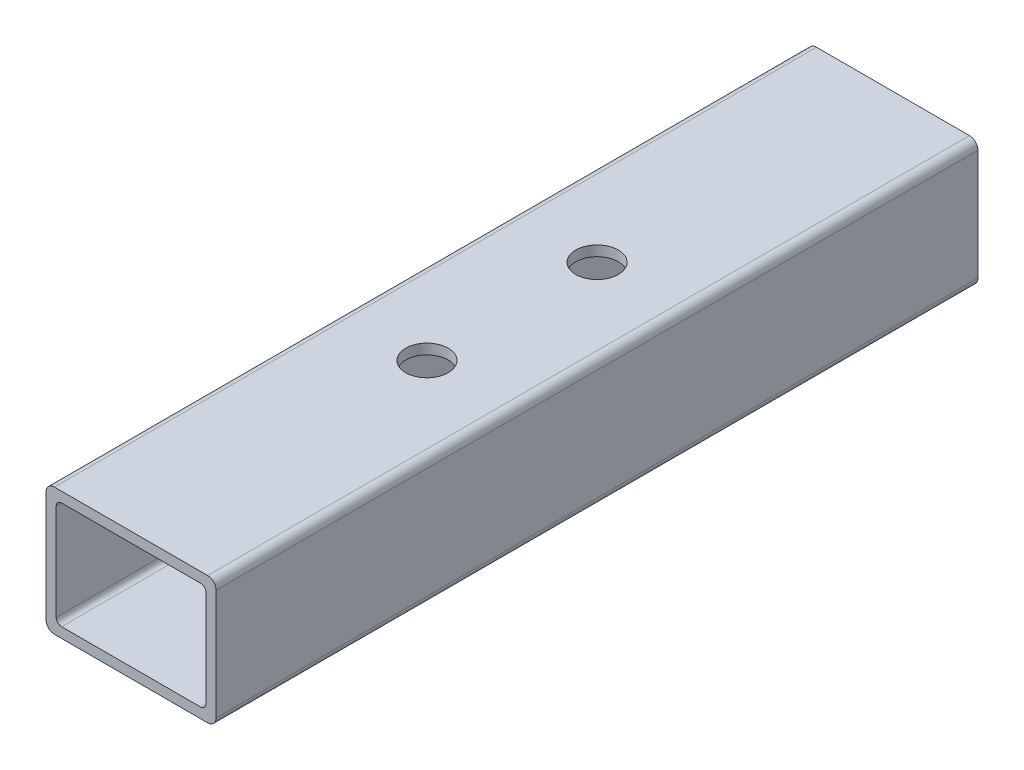
ISO-10303-21;
HEADER;
FILE_DESCRIPTION(('STEP AP214'),'2;1');
FILE_NAME('part.step','',(''),(''),'','','');
FILE_SCHEMA(('AUTOMOTIVE_DESIGN { 1 0 10303 214 1 1 1 1 }'));
ENDSEC;
DATA;
#1=APPLICATION_CONTEXT('core data for automotive mechanical design processes');
#2=APPLICATION_PROTOCOL_DEFINITION('international standard','automotive_design',2000,#1);
#3=PRODUCT_CONTEXT('',#1,'mechanical');
#4=PRODUCT('Part','Part','',(#3));
#5=PRODUCT_RELATED_PRODUCT_CATEGORY('part','',(#4));
#6=PRODUCT_DEFINITION_FORMATION('','',#4);
#7=PRODUCT_DEFINITION_CONTEXT('part definition',#1,'design');
#8=PRODUCT_DEFINITION('design','',#6,#7);
#9=PRODUCT_DEFINITION_SHAPE('','',#8);
#10=(LENGTH_UNIT() NAMED_UNIT(*) SI_UNIT(.MILLI.,.METRE.));
#11=(NAMED_UNIT(*) PLANE_ANGLE_UNIT() SI_UNIT($,.RADIAN.));
#12=(NAMED_UNIT(*) SI_UNIT($,.STERADIAN.) SOLID_ANGLE_UNIT());
#13=UNCERTAINTY_MEASURE_WITH_UNIT(LENGTH_MEASURE(1.E-05),#10,'distance_accuracy_value','');
#14=(GEOMETRIC_REPRESENTATION_CONTEXT(3) GLOBAL_UNCERTAINTY_ASSIGNED_CONTEXT((#13)) GLOBAL_UNIT_ASSIGNED_CONTEXT((#10,
#11,#12)) REPRESENTATION_CONTEXT('',''));
#15=CARTESIAN_POINT('',(0.,0.,0.));
#16=DIRECTION('',(0.,0.,1.));
#17=DIRECTION('',(1.,0.,0.));
#18=AXIS2_PLACEMENT_3D('',#15,#16,#17);
#19=CARTESIAN_POINT('',(22.86,-16.51,227.56368));
#20=DIRECTION('',(0.,0.,1.));
#21=DIRECTION('',(1.,0.,0.));
#22=AXIS2_PLACEMENT_3D('',#19,#20,#21);
#23=PLANE('',#22);
#24=CARTESIAN_POINT('',(22.86,-16.51,227.56368));
#25=DIRECTION('',(0.,0.,1.));
#26=DIRECTION('',(1.,0.,0.));
#27=AXIS2_PLACEMENT_3D('',#24,#25,#26);
#28=CIRCLE('',#27,2.53999999999999);
#29=CARTESIAN_POINT('',(22.86,-19.05,227.56368));
#30=VERTEX_POINT('',#29);
#31=CARTESIAN_POINT('',(25.4,-16.51,227.56368));
#32=VERTEX_POINT('',#31);
#33=EDGE_CURVE('E219',#30,#32,#28,.T.);
#34=ORIENTED_EDGE('',*,*,#33,.T.);
#35=DIRECTION('',(0.,1.,0.));
#36=VECTOR('',#35,1.);
#37=CARTESIAN_POINT('',(25.4,-16.51,227.56368));
#38=LINE('',#37,#36);
#39=CARTESIAN_POINT('',(25.4,16.51,227.56368));
#40=VERTEX_POINT('',#39);
#41=EDGE_CURVE('E222',#32,#40,#38,.T.);
#42=ORIENTED_EDGE('',*,*,#41,.T.);
#43=CARTESIAN_POINT('',(22.86,16.51,227.56368));
#44=DIRECTION('',(0.,0.,1.));
#45=DIRECTION('',(1.,0.,0.));
#46=AXIS2_PLACEMENT_3D('',#43,#44,#45);
#47=CIRCLE('',#46,2.54);
#48=CARTESIAN_POINT('',(22.86,19.05,227.56368));
#49=VERTEX_POINT('',#48);
#50=EDGE_CURVE('E225',#40,#49,#47,.T.);
#51=ORIENTED_EDGE('',*,*,#50,.T.);
#52=DIRECTION('',(-1.,0.,0.));
#53=VECTOR('',#52,1.);
#54=CARTESIAN_POINT('',(22.86,19.05,227.56368));
#55=LINE('',#54,#53);
#56=CARTESIAN_POINT('',(-22.86,19.05,227.56368));
#57=VERTEX_POINT('',#56);
#58=EDGE_CURVE('E227',#49,#57,#55,.T.);
#59=ORIENTED_EDGE('',*,*,#58,.T.);
#60=CARTESIAN_POINT('',(-22.86,16.51,227.56368));
#61=DIRECTION('',(0.,0.,1.));
#62=DIRECTION('',(1.,0.,0.));
#63=AXIS2_PLACEMENT_3D('',#60,#61,#62);
#64=CIRCLE('',#63,2.54);
#65=CARTESIAN_POINT('',(-25.4,16.51,227.56368));
#66=VERTEX_POINT('',#65);
#67=EDGE_CURVE('E229',#57,#66,#64,.T.);
#68=ORIENTED_EDGE('',*,*,#67,.T.);
#69=DIRECTION('',(0.,-1.,0.));
#70=VECTOR('',#69,1.);
#71=CARTESIAN_POINT('',(-25.4,-16.51,227.56368));
#72=LINE('',#71,#70);
#73=CARTESIAN_POINT('',(-25.4,-16.51,227.56368));
#74=VERTEX_POINT('',#73);
#75=EDGE_CURVE('E231',#66,#74,#72,.T.);
#76=ORIENTED_EDGE('',*,*,#75,.T.);
#77=CARTESIAN_POINT('',(-22.86,-16.51,227.56368));
#78=DIRECTION('',(0.,0.,1.));
#79=DIRECTION('',(1.,0.,0.));
#80=AXIS2_PLACEMENT_3D('',#77,#78,#79);
#81=CIRCLE('',#80,2.54);
#82=CARTESIAN_POINT('',(-22.86,-19.05,227.56368));
#83=VERTEX_POINT('',#82);
#84=EDGE_CURVE('E233',#74,#83,#81,.T.);
#85=ORIENTED_EDGE('',*,*,#84,.T.);
#86=DIRECTION('',(1.,0.,0.));
#87=VECTOR('',#86,1.);
#88=CARTESIAN_POINT('',(22.86,-19.05,227.56368));
#89=LINE('',#88,#87);
#90=EDGE_CURVE('E235',#83,#30,#89,.T.);
#91=ORIENTED_EDGE('',*,*,#90,.T.);
#92=EDGE_LOOP('',(#34,#42,#51,#59,#68,#76,#85,#91));
#93=FACE_BOUND('',#92,.T.);
#94=DIRECTION('',(-1.,0.,0.));
#95=VECTOR('',#94,1.);
#96=CARTESIAN_POINT('',(20.7518,16.002,227.56368));
#97=LINE('',#96,#95);
#98=CARTESIAN_POINT('',(20.7518,16.002,227.56368));
#99=VERTEX_POINT('',#98);
#100=CARTESIAN_POINT('',(-20.7518,16.002,227.56368));
#101=VERTEX_POINT('',#100);
#102=EDGE_CURVE('E160',#99,#101,#97,.T.);
#103=ORIENTED_EDGE('',*,*,#102,.F.);
#104=CARTESIAN_POINT('',(20.7518,14.4018,227.56368));
#105=DIRECTION('',(0.,0.,1.));
#106=DIRECTION('',(1.,0.,0.));
#107=AXIS2_PLACEMENT_3D('',#104,#105,#106);
#108=CIRCLE('',#107,1.6002);
#109=CARTESIAN_POINT('',(22.352,14.4018,227.56368));
#110=VERTEX_POINT('',#109);
#111=EDGE_CURVE('E152',#110,#99,#108,.T.);
#112=ORIENTED_EDGE('',*,*,#111,.F.);
#113=DIRECTION('',(0.,1.,0.));
#114=VECTOR('',#113,1.);
#115=CARTESIAN_POINT('',(22.352,14.4018,227.56368));
#116=LINE('',#115,#114);
#117=CARTESIAN_POINT('',(22.352,-14.4018,227.56368));
#118=VERTEX_POINT('',#117);
#119=EDGE_CURVE('E186',#118,#110,#116,.T.);
#120=ORIENTED_EDGE('',*,*,#119,.F.);
#121=CARTESIAN_POINT('',(20.7518,-14.4018,227.56368));
#122=DIRECTION('',(0.,0.,1.));
#123=DIRECTION('',(1.,0.,0.));
#124=AXIS2_PLACEMENT_3D('',#121,#122,#123);
#125=CIRCLE('',#124,1.6002);
#126=CARTESIAN_POINT('',(20.7518,-16.002,227.56368));
#127=VERTEX_POINT('',#126);
#128=EDGE_CURVE('E184',#127,#118,#125,.T.);
#129=ORIENTED_EDGE('',*,*,#128,.F.);
#130=DIRECTION('',(1.,0.,0.));
#131=VECTOR('',#130,1.);
#132=CARTESIAN_POINT('',(20.7518,-16.002,227.56368));
#133=LINE('',#132,#131);
#134=CARTESIAN_POINT('',(-20.7518,-16.002,227.56368));
#135=VERTEX_POINT('',#134);
#136=EDGE_CURVE('E182',#135,#127,#133,.T.);
#137=ORIENTED_EDGE('',*,*,#136,.F.);
#138=CARTESIAN_POINT('',(-20.7518,-14.4018,227.56368));
#139=DIRECTION('',(0.,0.,1.));
#140=DIRECTION('',(1.,0.,0.));
#141=AXIS2_PLACEMENT_3D('',#138,#139,#140);
#142=CIRCLE('',#141,1.6002);
#143=CARTESIAN_POINT('',(-22.352,-14.4018,227.56368));
#144=VERTEX_POINT('',#143);
#145=EDGE_CURVE('E180',#144,#135,#142,.T.);
#146=ORIENTED_EDGE('',*,*,#145,.F.);
#147=DIRECTION('',(0.,-1.,0.));
#148=VECTOR('',#147,1.);
#149=CARTESIAN_POINT('',(-22.352,14.4018,227.56368));
#150=LINE('',#149,#148);
#151=CARTESIAN_POINT('',(-22.352,14.4018,227.56368));
#152=VERTEX_POINT('',#151);
#153=EDGE_CURVE('E175',#152,#144,#150,.T.);
#154=ORIENTED_EDGE('',*,*,#153,.F.);
#155=CARTESIAN_POINT('',(-20.7518,14.4018,227.56368));
#156=DIRECTION('',(0.,0.,1.));
#157=DIRECTION('',(1.,0.,0.));
#158=AXIS2_PLACEMENT_3D('',#155,#156,#157);
#159=CIRCLE('',#158,1.6002);
#160=EDGE_CURVE('E173',#101,#152,#159,.T.);
#161=ORIENTED_EDGE('',*,*,#160,.F.);
#162=EDGE_LOOP('',(#103,#112,#120,#129,#137,#146,#154,#161));
#163=FACE_BOUND('',#162,.T.);
#164=ADVANCED_FACE('F39',(#93,#163),#23,.T.);
#165=CARTESIAN_POINT('',(22.86,-16.51,0.));
#166=DIRECTION('',(0.,0.,1.));
#167=DIRECTION('',(1.,0.,0.));
#168=AXIS2_PLACEMENT_3D('',#165,#166,#167);
#169=PLANE('',#168);
#170=CARTESIAN_POINT('',(22.86,-16.51,0.));
#171=DIRECTION('',(0.,0.,1.));
#172=DIRECTION('',(1.,0.,0.));
#173=AXIS2_PLACEMENT_3D('',#170,#171,#172);
#174=CIRCLE('',#173,2.53999999999999);
#175=CARTESIAN_POINT('',(22.86,-19.05,0.));
#176=VERTEX_POINT('',#175);
#177=CARTESIAN_POINT('',(25.4,-16.51,0.));
#178=VERTEX_POINT('',#177);
#179=EDGE_CURVE('E168',#176,#178,#174,.T.);
#180=ORIENTED_EDGE('',*,*,#179,.F.);
#181=DIRECTION('',(1.,0.,0.));
#182=VECTOR('',#181,1.);
#183=CARTESIAN_POINT('',(22.86,-19.05,0.));
#184=LINE('',#183,#182);
#185=CARTESIAN_POINT('',(-22.86,-19.05,0.));
#186=VERTEX_POINT('',#185);
#187=EDGE_CURVE('E223',#186,#176,#184,.T.);
#188=ORIENTED_EDGE('',*,*,#187,.F.);
#189=CARTESIAN_POINT('',(-22.86,-16.51,0.));
#190=DIRECTION('',(0.,0.,1.));
#191=DIRECTION('',(1.,0.,0.));
#192=AXIS2_PLACEMENT_3D('',#189,#190,#191);
#193=CIRCLE('',#192,2.54);
#194=CARTESIAN_POINT('',(-25.4,-16.51,0.));
#195=VERTEX_POINT('',#194);
#196=EDGE_CURVE('E250',#195,#186,#193,.T.);
#197=ORIENTED_EDGE('',*,*,#196,.F.);
#198=DIRECTION('',(0.,-1.,0.));
#199=VECTOR('',#198,1.);
#200=CARTESIAN_POINT('',(-25.4,-16.51,0.));
#201=LINE('',#200,#199);
#202=CARTESIAN_POINT('',(-25.4,16.51,0.));
#203=VERTEX_POINT('',#202);
#204=EDGE_CURVE('E248',#203,#195,#201,.T.);
#205=ORIENTED_EDGE('',*,*,#204,.F.);
#206=CARTESIAN_POINT('',(-22.86,16.51,0.));
#207=DIRECTION('',(0.,0.,1.));
#208=DIRECTION('',(1.,0.,0.));
#209=AXIS2_PLACEMENT_3D('',#206,#207,#208);
#210=CIRCLE('',#209,2.54);
#211=CARTESIAN_POINT('',(-22.86,19.05,0.));
#212=VERTEX_POINT('',#211);
#213=EDGE_CURVE('E246',#212,#203,#210,.T.);
#214=ORIENTED_EDGE('',*,*,#213,.F.);
#215=DIRECTION('',(-1.,0.,0.));
#216=VECTOR('',#215,1.);
#217=CARTESIAN_POINT('',(22.86,19.05,0.));
#218=LINE('',#217,#216);
#219=CARTESIAN_POINT('',(22.86,19.05,0.));
#220=VERTEX_POINT('',#219);
#221=EDGE_CURVE('E244',#220,#212,#218,.T.);
#222=ORIENTED_EDGE('',*,*,#221,.F.);
#223=CARTESIAN_POINT('',(22.86,16.51,0.));
#224=DIRECTION('',(0.,0.,1.));
#225=DIRECTION('',(1.,0.,0.));
#226=AXIS2_PLACEMENT_3D('',#223,#224,#225);
#227=CIRCLE('',#226,2.54);
#228=CARTESIAN_POINT('',(25.4,16.51,0.));
#229=VERTEX_POINT('',#228);
#230=EDGE_CURVE('E242',#229,#220,#227,.T.);
#231=ORIENTED_EDGE('',*,*,#230,.F.);
#232=DIRECTION('',(0.,1.,0.));
#233=VECTOR('',#232,1.);
#234=CARTESIAN_POINT('',(25.4,-16.51,0.));
#235=LINE('',#234,#233);
#236=EDGE_CURVE('E240',#178,#229,#235,.T.);
#237=ORIENTED_EDGE('',*,*,#236,.F.);
#238=EDGE_LOOP('',(#180,#188,#197,#205,#214,#222,#231,#237));
#239=FACE_BOUND('',#238,.T.);
#240=CARTESIAN_POINT('',(20.7518,14.4018,0.));
#241=DIRECTION('',(0.,0.,1.));
#242=DIRECTION('',(1.,0.,0.));
#243=AXIS2_PLACEMENT_3D('',#240,#241,#242);
#244=CIRCLE('',#243,1.6002);
#245=CARTESIAN_POINT('',(22.352,14.4018,0.));
#246=VERTEX_POINT('',#245);
#247=CARTESIAN_POINT('',(20.7518,16.002,0.));
#248=VERTEX_POINT('',#247);
#249=EDGE_CURVE('E62',#246,#248,#244,.T.);
#250=ORIENTED_EDGE('',*,*,#249,.T.);
#251=DIRECTION('',(-1.,0.,0.));
#252=VECTOR('',#251,1.);
#253=CARTESIAN_POINT('',(20.7518,16.002,0.));
#254=LINE('',#253,#252);
#255=CARTESIAN_POINT('',(-20.7518,16.002,0.));
#256=VERTEX_POINT('',#255);
#257=EDGE_CURVE('E167',#248,#256,#254,.T.);
#258=ORIENTED_EDGE('',*,*,#257,.T.);
#259=CARTESIAN_POINT('',(-20.7518,14.4018,0.));
#260=DIRECTION('',(0.,0.,1.));
#261=DIRECTION('',(1.,0.,0.));
#262=AXIS2_PLACEMENT_3D('',#259,#260,#261);
#263=CIRCLE('',#262,1.6002);
#264=CARTESIAN_POINT('',(-22.352,14.4018,0.));
#265=VERTEX_POINT('',#264);
#266=EDGE_CURVE('E191',#256,#265,#263,.T.);
#267=ORIENTED_EDGE('',*,*,#266,.T.);
#268=DIRECTION('',(0.,-1.,0.));
#269=VECTOR('',#268,1.);
#270=CARTESIAN_POINT('',(-22.352,14.4018,0.));
#271=LINE('',#270,#269);
#272=CARTESIAN_POINT('',(-22.352,-14.4018,0.));
#273=VERTEX_POINT('',#272);
#274=EDGE_CURVE('E194',#265,#273,#271,.T.);
#275=ORIENTED_EDGE('',*,*,#274,.T.);
#276=CARTESIAN_POINT('',(-20.7518,-14.4018,0.));
#277=DIRECTION('',(0.,0.,1.));
#278=DIRECTION('',(1.,0.,0.));
#279=AXIS2_PLACEMENT_3D('',#276,#277,#278);
#280=CIRCLE('',#279,1.6002);
#281=CARTESIAN_POINT('',(-20.7518,-16.002,0.));
#282=VERTEX_POINT('',#281);
#283=EDGE_CURVE('E197',#273,#282,#280,.T.);
#284=ORIENTED_EDGE('',*,*,#283,.T.);
#285=DIRECTION('',(1.,0.,0.));
#286=VECTOR('',#285,1.);
#287=CARTESIAN_POINT('',(20.7518,-16.002,0.));
#288=LINE('',#287,#286);
#289=CARTESIAN_POINT('',(20.7518,-16.002,0.));
#290=VERTEX_POINT('',#289);
#291=EDGE_CURVE('E200',#282,#290,#288,.T.);
#292=ORIENTED_EDGE('',*,*,#291,.T.);
#293=CARTESIAN_POINT('',(20.7518,-14.4018,0.));
#294=DIRECTION('',(0.,0.,1.));
#295=DIRECTION('',(1.,0.,0.));
#296=AXIS2_PLACEMENT_3D('',#293,#294,#295);
#297=CIRCLE('',#296,1.6002);
#298=CARTESIAN_POINT('',(22.352,-14.4018,0.));
#299=VERTEX_POINT('',#298);
#300=EDGE_CURVE('E203',#290,#299,#297,.T.);
#301=ORIENTED_EDGE('',*,*,#300,.T.);
#302=DIRECTION('',(0.,1.,0.));
#303=VECTOR('',#302,1.);
#304=CARTESIAN_POINT('',(22.352,14.4018,0.));
#305=LINE('',#304,#303);
#306=EDGE_CURVE('E161',#299,#246,#305,.T.);
#307=ORIENTED_EDGE('',*,*,#306,.T.);
#308=EDGE_LOOP('',(#250,#258,#267,#275,#284,#292,#301,#307));
#309=FACE_BOUND('',#308,.T.);
#310=ADVANCED_FACE('F280',(#239,#309),#169,.F.);
#311=CARTESIAN_POINT('',(22.86,-16.51,227.56368));
#312=DIRECTION('',(0.,0.,-1.));
#313=DIRECTION('',(-1.,0.,0.));
#314=AXIS2_PLACEMENT_3D('',#311,#312,#313);
#315=CYLINDRICAL_SURFACE('',#314,2.53999999999999);
#316=ORIENTED_EDGE('',*,*,#179,.T.);
#317=DIRECTION('',(0.,0.,-1.));
#318=VECTOR('',#317,1.);
#319=CARTESIAN_POINT('',(25.4,-16.51,227.56368));
#320=LINE('',#319,#318);
#321=EDGE_CURVE('E11',#32,#178,#320,.T.);
#322=ORIENTED_EDGE('',*,*,#321,.F.);
#323=ORIENTED_EDGE('',*,*,#33,.F.);
#324=DIRECTION('',(0.,0.,-1.));
#325=VECTOR('',#324,1.);
#326=CARTESIAN_POINT('',(22.86,-19.05,227.56368));
#327=LINE('',#326,#325);
#328=EDGE_CURVE('E237',#30,#176,#327,.T.);
#329=ORIENTED_EDGE('',*,*,#328,.T.);
#330=EDGE_LOOP('',(#316,#322,#323,#329));
#331=FACE_BOUND('',#330,.T.);
#332=ADVANCED_FACE('F41',(#331),#315,.T.);
#333=CARTESIAN_POINT('',(25.4,-16.51,227.56368));
#334=DIRECTION('',(-1.,0.,0.));
#335=DIRECTION('',(0.,0.,1.));
#336=AXIS2_PLACEMENT_3D('',#333,#334,#335);
#337=PLANE('',#336);
#338=ORIENTED_EDGE('',*,*,#236,.T.);
#339=DIRECTION('',(0.,0.,-1.));
#340=VECTOR('',#339,1.);
#341=CARTESIAN_POINT('',(25.4,16.51,227.56368));
#342=LINE('',#341,#340);
#343=EDGE_CURVE('E47',#40,#229,#342,.T.);
#344=ORIENTED_EDGE('',*,*,#343,.F.);
#345=ORIENTED_EDGE('',*,*,#41,.F.);
#346=ORIENTED_EDGE('',*,*,#321,.T.);
#347=EDGE_LOOP('',(#338,#344,#345,#346));
#348=FACE_BOUND('',#347,.T.);
#349=ADVANCED_FACE('F297',(#348),#337,.F.);
#350=CARTESIAN_POINT('',(22.86,16.51,227.56368));
#351=DIRECTION('',(0.,0.,-1.));
#352=DIRECTION('',(-1.,0.,0.));
#353=AXIS2_PLACEMENT_3D('',#350,#351,#352);
#354=CYLINDRICAL_SURFACE('',#353,2.54);
#355=ORIENTED_EDGE('',*,*,#230,.T.);
#356=DIRECTION('',(0.,0.,-1.));
#357=VECTOR('',#356,1.);
#358=CARTESIAN_POINT('',(22.86,19.05,227.56368));
#359=LINE('',#358,#357);
#360=EDGE_CURVE('E267',#49,#220,#359,.T.);
#361=ORIENTED_EDGE('',*,*,#360,.F.);
#362=ORIENTED_EDGE('',*,*,#50,.F.);
#363=ORIENTED_EDGE('',*,*,#343,.T.);
#364=EDGE_LOOP('',(#355,#361,#362,#363));
#365=FACE_BOUND('',#364,.T.);
#366=ADVANCED_FACE('F274',(#365),#354,.T.);
#367=CARTESIAN_POINT('',(22.86,19.05,227.56368));
#368=DIRECTION('',(0.,-1.,0.));
#369=DIRECTION('',(0.,0.,-1.));
#370=AXIS2_PLACEMENT_3D('',#367,#368,#369);
#371=PLANE('',#370);
#372=CARTESIAN_POINT('',(0.,19.05,139.18184));
#373=DIRECTION('',(0.,1.,0.));
#374=DIRECTION('',(0.,0.,1.));
#375=AXIS2_PLACEMENT_3D('',#372,#373,#374);
#376=CIRCLE('',#375,6.34999999999999);
#377=CARTESIAN_POINT('',(0.,19.05,145.53184));
#378=VERTEX_POINT('',#377);
#379=EDGE_CURVE('E189',#378,#378,#376,.T.);
#380=ORIENTED_EDGE('',*,*,#379,.F.);
#381=EDGE_LOOP('',(#380));
#382=FACE_BOUND('',#381,.T.);
#383=CARTESIAN_POINT('',(0.,19.05,88.38184));
#384=DIRECTION('',(0.,1.,0.));
#385=DIRECTION('',(0.,0.,1.));
#386=AXIS2_PLACEMENT_3D('',#383,#384,#385);
#387=CIRCLE('',#386,6.34999999999999);
#388=CARTESIAN_POINT('',(0.,19.05,94.73184));
#389=VERTEX_POINT('',#388);
#390=EDGE_CURVE('E380',#389,#389,#387,.T.);
#391=ORIENTED_EDGE('',*,*,#390,.F.);
#392=EDGE_LOOP('',(#391));
#393=FACE_BOUND('',#392,.T.);
#394=ORIENTED_EDGE('',*,*,#221,.T.);
#395=DIRECTION('',(0.,0.,-1.));
#396=VECTOR('',#395,1.);
#397=CARTESIAN_POINT('',(-22.86,19.05,227.56368));
#398=LINE('',#397,#396);
#399=EDGE_CURVE('E264',#57,#212,#398,.T.);
#400=ORIENTED_EDGE('',*,*,#399,.F.);
#401=ORIENTED_EDGE('',*,*,#58,.F.);
#402=ORIENTED_EDGE('',*,*,#360,.T.);
#403=EDGE_LOOP('',(#394,#400,#401,#402));
#404=FACE_BOUND('',#403,.T.);
#405=ADVANCED_FACE('F286',(#382,#393,#404),#371,.F.);
#406=CARTESIAN_POINT('',(-22.86,16.51,227.56368));
#407=DIRECTION('',(0.,0.,-1.));
#408=DIRECTION('',(-1.,0.,0.));
#409=AXIS2_PLACEMENT_3D('',#406,#407,#408);
#410=CYLINDRICAL_SURFACE('',#409,2.54);
#411=ORIENTED_EDGE('',*,*,#213,.T.);
#412=DIRECTION('',(0.,0.,-1.));
#413=VECTOR('',#412,1.);
#414=CARTESIAN_POINT('',(-25.4,16.51,227.56368));
#415=LINE('',#414,#413);
#416=EDGE_CURVE('E261',#66,#203,#415,.T.);
#417=ORIENTED_EDGE('',*,*,#416,.F.);
#418=ORIENTED_EDGE('',*,*,#67,.F.);
#419=ORIENTED_EDGE('',*,*,#399,.T.);
#420=EDGE_LOOP('',(#411,#417,#418,#419));
#421=FACE_BOUND('',#420,.T.);
#422=ADVANCED_FACE('F290',(#421),#410,.T.);
#423=CARTESIAN_POINT('',(-25.4,-16.51,227.56368));
#424=DIRECTION('',(1.,0.,0.));
#425=DIRECTION('',(0.,1.,0.));
#426=AXIS2_PLACEMENT_3D('',#423,#424,#425);
#427=PLANE('',#426);
#428=ORIENTED_EDGE('',*,*,#204,.T.);
#429=DIRECTION('',(0.,0.,-1.));
#430=VECTOR('',#429,1.);
#431=CARTESIAN_POINT('',(-25.4,-16.51,227.56368));
#432=LINE('',#431,#430);
#433=EDGE_CURVE('E258',#74,#195,#432,.T.);
#434=ORIENTED_EDGE('',*,*,#433,.F.);
#435=ORIENTED_EDGE('',*,*,#75,.F.);
#436=ORIENTED_EDGE('',*,*,#416,.T.);
#437=EDGE_LOOP('',(#428,#434,#435,#436));
#438=FACE_BOUND('',#437,.T.);
#439=ADVANCED_FACE('F310',(#438),#427,.F.);
#440=CARTESIAN_POINT('',(-22.86,-16.51,227.56368));
#441=DIRECTION('',(0.,0.,-1.));
#442=DIRECTION('',(-1.,0.,0.));
#443=AXIS2_PLACEMENT_3D('',#440,#441,#442);
#444=CYLINDRICAL_SURFACE('',#443,2.54);
#445=ORIENTED_EDGE('',*,*,#196,.T.);
#446=DIRECTION('',(0.,0.,-1.));
#447=VECTOR('',#446,1.);
#448=CARTESIAN_POINT('',(-22.86,-19.05,227.56368));
#449=LINE('',#448,#447);
#450=EDGE_CURVE('E255',#83,#186,#449,.T.);
#451=ORIENTED_EDGE('',*,*,#450,.F.);
#452=ORIENTED_EDGE('',*,*,#84,.F.);
#453=ORIENTED_EDGE('',*,*,#433,.T.);
#454=EDGE_LOOP('',(#445,#451,#452,#453));
#455=FACE_BOUND('',#454,.T.);
#456=ADVANCED_FACE('F308',(#455),#444,.T.);
#457=CARTESIAN_POINT('',(22.86,-19.05,227.56368));
#458=DIRECTION('',(0.,1.,0.));
#459=DIRECTION('',(-1.,0.,0.));
#460=AXIS2_PLACEMENT_3D('',#457,#458,#459);
#461=PLANE('',#460);
#462=ORIENTED_EDGE('',*,*,#187,.T.);
#463=ORIENTED_EDGE('',*,*,#328,.F.);
#464=ORIENTED_EDGE('',*,*,#90,.F.);
#465=ORIENTED_EDGE('',*,*,#450,.T.);
#466=EDGE_LOOP('',(#462,#463,#464,#465));
#467=FACE_BOUND('',#466,.T.);
#468=ADVANCED_FACE('F303',(#467),#461,.F.);
#469=CARTESIAN_POINT('',(20.7518,14.4018,227.56368));
#470=DIRECTION('',(0.,0.,-1.));
#471=DIRECTION('',(-1.,0.,0.));
#472=AXIS2_PLACEMENT_3D('',#469,#470,#471);
#473=CYLINDRICAL_SURFACE('',#472,1.6002);
#474=ORIENTED_EDGE('',*,*,#249,.F.);
#475=DIRECTION('',(0.,0.,-1.));
#476=VECTOR('',#475,1.);
#477=CARTESIAN_POINT('',(22.352,14.4018,227.56368));
#478=LINE('',#477,#476);
#479=EDGE_CURVE('E156',#110,#246,#478,.T.);
#480=ORIENTED_EDGE('',*,*,#479,.F.);
#481=ORIENTED_EDGE('',*,*,#111,.T.);
#482=DIRECTION('',(0.,0.,-1.));
#483=VECTOR('',#482,1.);
#484=CARTESIAN_POINT('',(20.7518,16.002,227.56368));
#485=LINE('',#484,#483);
#486=EDGE_CURVE('E155',#99,#248,#485,.T.);
#487=ORIENTED_EDGE('',*,*,#486,.T.);
#488=EDGE_LOOP('',(#474,#480,#481,#487));
#489=FACE_BOUND('',#488,.T.);
#490=ADVANCED_FACE('F154',(#489),#473,.F.);
#491=CARTESIAN_POINT('',(20.7518,16.002,227.56368));
#492=DIRECTION('',(0.,-1.,0.));
#493=DIRECTION('',(1.,0.,0.));
#494=AXIS2_PLACEMENT_3D('',#491,#492,#493);
#495=PLANE('',#494);
#496=CARTESIAN_POINT('',(0.,16.002,139.18184));
#497=DIRECTION('',(0.,-1.,0.));
#498=DIRECTION('',(1.,0.,0.));
#499=AXIS2_PLACEMENT_3D('',#496,#497,#498);
#500=CIRCLE('',#499,6.34999999999999);
#501=CARTESIAN_POINT('',(6.35,16.002,139.18184));
#502=VERTEX_POINT('',#501);
#503=EDGE_CURVE('E375',#502,#502,#500,.F.);
#504=ORIENTED_EDGE('',*,*,#503,.T.);
#505=EDGE_LOOP('',(#504));
#506=FACE_BOUND('',#505,.T.);
#507=CARTESIAN_POINT('',(0.,16.002,88.38184));
#508=DIRECTION('',(0.,-1.,0.));
#509=DIRECTION('',(1.,0.,0.));
#510=AXIS2_PLACEMENT_3D('',#507,#508,#509);
#511=CIRCLE('',#510,6.34999999999999);
#512=CARTESIAN_POINT('',(6.35,16.002,88.38184));
#513=VERTEX_POINT('',#512);
#514=EDGE_CURVE('E383',#513,#513,#511,.F.);
#515=ORIENTED_EDGE('',*,*,#514,.T.);
#516=EDGE_LOOP('',(#515));
#517=FACE_BOUND('',#516,.T.);
#518=ORIENTED_EDGE('',*,*,#257,.F.);
#519=ORIENTED_EDGE('',*,*,#486,.F.);
#520=ORIENTED_EDGE('',*,*,#102,.T.);
#521=DIRECTION('',(0.,0.,-1.));
#522=VECTOR('',#521,1.);
#523=CARTESIAN_POINT('',(-20.7518,16.002,227.56368));
#524=LINE('',#523,#522);
#525=EDGE_CURVE('E169',#101,#256,#524,.T.);
#526=ORIENTED_EDGE('',*,*,#525,.T.);
#527=EDGE_LOOP('',(#518,#519,#520,#526));
#528=FACE_BOUND('',#527,.T.);
#529=ADVANCED_FACE('F164',(#506,#517,#528),#495,.T.);
#530=CARTESIAN_POINT('',(-20.7518,14.4018,227.56368));
#531=DIRECTION('',(0.,0.,-1.));
#532=DIRECTION('',(-1.,0.,0.));
#533=AXIS2_PLACEMENT_3D('',#530,#531,#532);
#534=CYLINDRICAL_SURFACE('',#533,1.6002);
#535=ORIENTED_EDGE('',*,*,#266,.F.);
#536=ORIENTED_EDGE('',*,*,#525,.F.);
#537=ORIENTED_EDGE('',*,*,#160,.T.);
#538=DIRECTION('',(0.,0.,-1.));
#539=VECTOR('',#538,1.);
#540=CARTESIAN_POINT('',(-22.352,14.4018,227.56368));
#541=LINE('',#540,#539);
#542=EDGE_CURVE('E216',#152,#265,#541,.T.);
#543=ORIENTED_EDGE('',*,*,#542,.T.);
#544=EDGE_LOOP('',(#535,#536,#537,#543));
#545=FACE_BOUND('',#544,.T.);
#546=ADVANCED_FACE('F335',(#545),#534,.F.);
#547=CARTESIAN_POINT('',(-22.352,14.4018,227.56368));
#548=DIRECTION('',(1.,0.,0.));
#549=DIRECTION('',(0.,1.,0.));
#550=AXIS2_PLACEMENT_3D('',#547,#548,#549);
#551=PLANE('',#550);
#552=ORIENTED_EDGE('',*,*,#274,.F.);
#553=ORIENTED_EDGE('',*,*,#542,.F.);
#554=ORIENTED_EDGE('',*,*,#153,.T.);
#555=DIRECTION('',(0.,0.,-1.));
#556=VECTOR('',#555,1.);
#557=CARTESIAN_POINT('',(-22.352,-14.4018,227.56368));
#558=LINE('',#557,#556);
#559=EDGE_CURVE('E214',#144,#273,#558,.T.);
#560=ORIENTED_EDGE('',*,*,#559,.T.);
#561=EDGE_LOOP('',(#552,#553,#554,#560));
#562=FACE_BOUND('',#561,.T.);
#563=ADVANCED_FACE('F340',(#562),#551,.T.);
#564=CARTESIAN_POINT('',(-20.7518,-14.4018,227.56368));
#565=DIRECTION('',(0.,0.,-1.));
#566=DIRECTION('',(-1.,0.,0.));
#567=AXIS2_PLACEMENT_3D('',#564,#565,#566);
#568=CYLINDRICAL_SURFACE('',#567,1.6002);
#569=ORIENTED_EDGE('',*,*,#283,.F.);
#570=ORIENTED_EDGE('',*,*,#559,.F.);
#571=ORIENTED_EDGE('',*,*,#145,.T.);
#572=DIRECTION('',(0.,0.,-1.));
#573=VECTOR('',#572,1.);
#574=CARTESIAN_POINT('',(-20.7518,-16.002,227.56368));
#575=LINE('',#574,#573);
#576=EDGE_CURVE('E212',#135,#282,#575,.T.);
#577=ORIENTED_EDGE('',*,*,#576,.T.);
#578=EDGE_LOOP('',(#569,#570,#571,#577));
#579=FACE_BOUND('',#578,.T.);
#580=ADVANCED_FACE('F348',(#579),#568,.F.);
#581=CARTESIAN_POINT('',(20.7518,-16.002,227.56368));
#582=DIRECTION('',(0.,1.,0.));
#583=DIRECTION('',(-1.,0.,0.));
#584=AXIS2_PLACEMENT_3D('',#581,#582,#583);
#585=PLANE('',#584);
#586=ORIENTED_EDGE('',*,*,#291,.F.);
#587=ORIENTED_EDGE('',*,*,#576,.F.);
#588=ORIENTED_EDGE('',*,*,#136,.T.);
#589=DIRECTION('',(0.,0.,-1.));
#590=VECTOR('',#589,1.);
#591=CARTESIAN_POINT('',(20.7518,-16.002,227.56368));
#592=LINE('',#591,#590);
#593=EDGE_CURVE('E210',#127,#290,#592,.T.);
#594=ORIENTED_EDGE('',*,*,#593,.T.);
#595=EDGE_LOOP('',(#586,#587,#588,#594));
#596=FACE_BOUND('',#595,.T.);
#597=ADVANCED_FACE('F352',(#596),#585,.T.);
#598=CARTESIAN_POINT('',(20.7518,-14.4018,227.56368));
#599=DIRECTION('',(0.,0.,-1.));
#600=DIRECTION('',(-1.,0.,0.));
#601=AXIS2_PLACEMENT_3D('',#598,#599,#600);
#602=CYLINDRICAL_SURFACE('',#601,1.6002);
#603=ORIENTED_EDGE('',*,*,#300,.F.);
#604=ORIENTED_EDGE('',*,*,#593,.F.);
#605=ORIENTED_EDGE('',*,*,#128,.T.);
#606=DIRECTION('',(0.,0.,-1.));
#607=VECTOR('',#606,1.);
#608=CARTESIAN_POINT('',(22.352,-14.4018,227.56368));
#609=LINE('',#608,#607);
#610=EDGE_CURVE('E54',#118,#299,#609,.T.);
#611=ORIENTED_EDGE('',*,*,#610,.T.);
#612=EDGE_LOOP('',(#603,#604,#605,#611));
#613=FACE_BOUND('',#612,.T.);
#614=ADVANCED_FACE('F356',(#613),#602,.F.);
#615=CARTESIAN_POINT('',(22.352,14.4018,227.56368));
#616=DIRECTION('',(-1.,0.,0.));
#617=DIRECTION('',(0.,-1.,0.));
#618=AXIS2_PLACEMENT_3D('',#615,#616,#617);
#619=PLANE('',#618);
#620=ORIENTED_EDGE('',*,*,#306,.F.);
#621=ORIENTED_EDGE('',*,*,#610,.F.);
#622=ORIENTED_EDGE('',*,*,#119,.T.);
#623=ORIENTED_EDGE('',*,*,#479,.T.);
#624=EDGE_LOOP('',(#620,#621,#622,#623));
#625=FACE_BOUND('',#624,.T.);
#626=ADVANCED_FACE('F360',(#625),#619,.T.);
#627=CARTESIAN_POINT('',(0.,-19.051,88.38184));
#628=DIRECTION('',(0.,1.,0.));
#629=DIRECTION('',(-1.,0.,0.));
#630=AXIS2_PLACEMENT_3D('',#627,#628,#629);
#631=CYLINDRICAL_SURFACE('',#630,6.34999999999999);
#632=ORIENTED_EDGE('',*,*,#514,.F.);
#633=EDGE_LOOP('',(#632));
#634=FACE_BOUND('',#633,.T.);
#635=ORIENTED_EDGE('',*,*,#390,.T.);
#636=EDGE_LOOP('',(#635));
#637=FACE_BOUND('',#636,.T.);
#638=ADVANCED_FACE('F364',(#634,#637),#631,.F.);
#639=CARTESIAN_POINT('',(0.,-19.051,139.18184));
#640=DIRECTION('',(0.,1.,0.));
#641=DIRECTION('',(-1.,0.,0.));
#642=AXIS2_PLACEMENT_3D('',#639,#640,#641);
#643=CYLINDRICAL_SURFACE('',#642,6.34999999999999);
#644=ORIENTED_EDGE('',*,*,#503,.F.);
#645=EDGE_LOOP('',(#644));
#646=FACE_BOUND('',#645,.T.);
#647=ORIENTED_EDGE('',*,*,#379,.T.);
#648=EDGE_LOOP('',(#647));
#649=FACE_BOUND('',#648,.T.);
#650=ADVANCED_FACE('F367',(#646,#649),#643,.F.);
#651=CLOSED_SHELL('',(#164,#310,#332,#349,#366,#405,#422,#439,#456,#468,#490,#529,#546,#563,
#580,#597,#614,#626,#638,#650));
#652=MANIFOLD_SOLID_BREP('B2',#651);
#653=ADVANCED_BREP_SHAPE_REPRESENTATION('',(#18,#652),#14);
#654=SHAPE_DEFINITION_REPRESENTATION(#9,#653);
ENDSEC;
END-ISO-10303-21;
